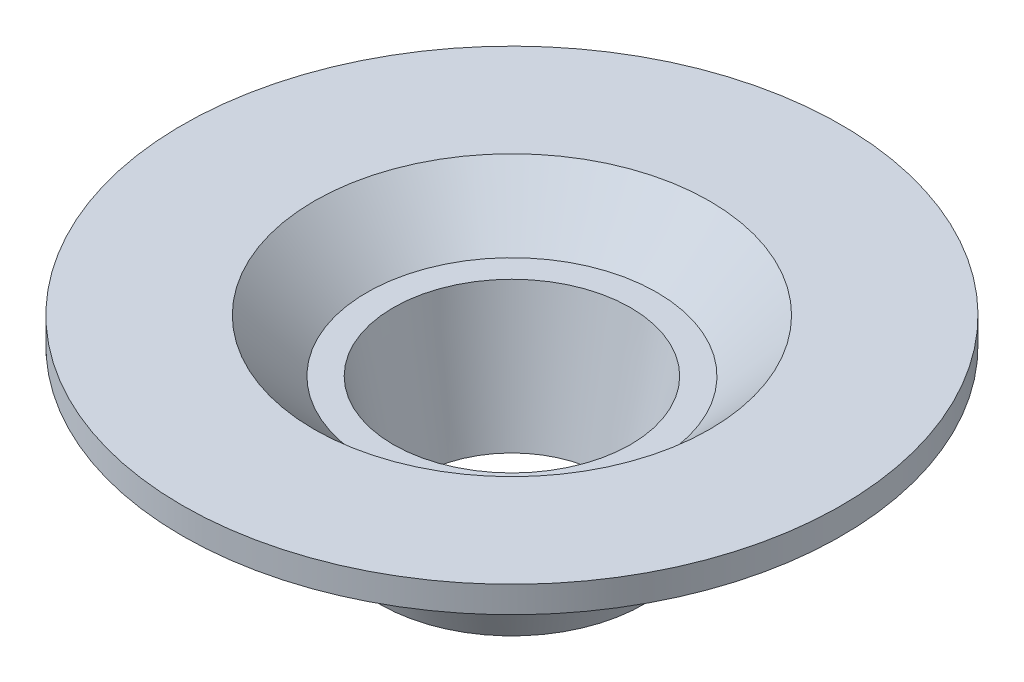
ISO-10303-21;
HEADER;
FILE_DESCRIPTION(('STEP AP214'),'2;1');
FILE_NAME('part.step','',(''),(''),'','','');
FILE_SCHEMA(('AUTOMOTIVE_DESIGN { 1 0 10303 214 1 1 1 1 }'));
ENDSEC;
DATA;
#1=APPLICATION_CONTEXT('core data for automotive mechanical design processes');
#2=APPLICATION_PROTOCOL_DEFINITION('international standard','automotive_design',2000,#1);
#3=PRODUCT_CONTEXT('',#1,'mechanical');
#4=PRODUCT('Part','Part','',(#3));
#5=PRODUCT_RELATED_PRODUCT_CATEGORY('part','',(#4));
#6=PRODUCT_DEFINITION_FORMATION('','',#4);
#7=PRODUCT_DEFINITION_CONTEXT('part definition',#1,'design');
#8=PRODUCT_DEFINITION('design','',#6,#7);
#9=PRODUCT_DEFINITION_SHAPE('','',#8);
#10=(LENGTH_UNIT() NAMED_UNIT(*) SI_UNIT(.MILLI.,.METRE.));
#11=(NAMED_UNIT(*) PLANE_ANGLE_UNIT() SI_UNIT($,.RADIAN.));
#12=(NAMED_UNIT(*) SI_UNIT($,.STERADIAN.) SOLID_ANGLE_UNIT());
#13=UNCERTAINTY_MEASURE_WITH_UNIT(LENGTH_MEASURE(1.E-05),#10,'distance_accuracy_value','');
#14=(GEOMETRIC_REPRESENTATION_CONTEXT(3) GLOBAL_UNCERTAINTY_ASSIGNED_CONTEXT((#13)) GLOBAL_UNIT_ASSIGNED_CONTEXT((#10,
#11,#12)) REPRESENTATION_CONTEXT('',''));
#15=CARTESIAN_POINT('',(0.,0.,0.));
#16=DIRECTION('',(0.,0.,1.));
#17=DIRECTION('',(1.,0.,0.));
#18=AXIS2_PLACEMENT_3D('',#15,#16,#17);
#19=CARTESIAN_POINT('',(0.,-8.13495637487969,-5.));
#20=DIRECTION('',(0.,1.,0.));
#21=DIRECTION('',(0.,0.,1.));
#22=AXIS2_PLACEMENT_3D('',#19,#20,#21);
#23=PLANE('',#22);
#24=CARTESIAN_POINT('',(0.,-8.13495637487969,0.));
#25=DIRECTION('',(0.,1.,0.));
#26=DIRECTION('',(0.,0.,1.));
#27=AXIS2_PLACEMENT_3D('',#24,#25,#26);
#28=CIRCLE('',#27,5.);
#29=CARTESIAN_POINT('',(0.,-8.13495637487969,5.));
#30=VERTEX_POINT('',#29);
#31=EDGE_CURVE('E10',#30,#30,#28,.T.);
#32=ORIENTED_EDGE('',*,*,#31,.F.);
#33=EDGE_LOOP('',(#32));
#34=FACE_BOUND('',#33,.T.);
#35=CARTESIAN_POINT('',(0.,-8.13495637487969,0.));
#36=DIRECTION('',(0.,1.,0.));
#37=DIRECTION('',(0.,0.,1.));
#38=AXIS2_PLACEMENT_3D('',#35,#36,#37);
#39=CIRCLE('',#38,3.5);
#40=CARTESIAN_POINT('',(0.,-8.13495637487969,3.5));
#41=VERTEX_POINT('',#40);
#42=EDGE_CURVE('E80',#41,#41,#39,.T.);
#43=ORIENTED_EDGE('',*,*,#42,.T.);
#44=EDGE_LOOP('',(#43));
#45=FACE_BOUND('',#44,.T.);
#46=ADVANCED_FACE('F37',(#34,#45),#23,.F.);
#47=CARTESIAN_POINT('',(0.,-8.13495637487969,0.));
#48=DIRECTION('',(0.,1.,0.));
#49=DIRECTION('',(0.,0.,1.));
#50=AXIS2_PLACEMENT_3D('',#47,#48,#49);
#51=CONICAL_SURFACE('',#50,5.,0.358770670270572);
#52=CARTESIAN_POINT('',(0.,-4.13495637487969,0.));
#53=DIRECTION('',(0.,1.,0.));
#54=DIRECTION('',(0.,0.,1.));
#55=AXIS2_PLACEMENT_3D('',#52,#53,#54);
#56=CIRCLE('',#55,6.5);
#57=CARTESIAN_POINT('',(0.,-4.13495637487969,6.5));
#58=VERTEX_POINT('',#57);
#59=EDGE_CURVE('E44',#58,#58,#56,.T.);
#60=ORIENTED_EDGE('',*,*,#59,.F.);
#61=EDGE_LOOP('',(#60));
#62=FACE_BOUND('',#61,.T.);
#63=ORIENTED_EDGE('',*,*,#31,.T.);
#64=EDGE_LOOP('',(#63));
#65=FACE_BOUND('',#64,.T.);
#66=ADVANCED_FACE('F130',(#62,#65),#51,.T.);
#67=CARTESIAN_POINT('',(0.,-4.13495637487969,-8.5));
#68=DIRECTION('',(0.,1.,0.));
#69=DIRECTION('',(0.,0.,1.));
#70=AXIS2_PLACEMENT_3D('',#67,#68,#69);
#71=PLANE('',#70);
#72=CARTESIAN_POINT('',(0.,-4.13495637487969,0.));
#73=DIRECTION('',(0.,1.,0.));
#74=DIRECTION('',(0.,0.,1.));
#75=AXIS2_PLACEMENT_3D('',#72,#73,#74);
#76=CIRCLE('',#75,8.5);
#77=CARTESIAN_POINT('',(0.,-4.13495637487969,8.5));
#78=VERTEX_POINT('',#77);
#79=EDGE_CURVE('E49',#78,#78,#76,.T.);
#80=ORIENTED_EDGE('',*,*,#79,.F.);
#81=EDGE_LOOP('',(#80));
#82=FACE_BOUND('',#81,.T.);
#83=ORIENTED_EDGE('',*,*,#59,.T.);
#84=EDGE_LOOP('',(#83));
#85=FACE_BOUND('',#84,.T.);
#86=ADVANCED_FACE('F125',(#82,#85),#71,.F.);
#87=CARTESIAN_POINT('',(0.,-4.13495637487969,0.));
#88=DIRECTION('',(0.,1.,0.));
#89=DIRECTION('',(0.,0.,1.));
#90=AXIS2_PLACEMENT_3D('',#87,#88,#89);
#91=CONICAL_SURFACE('',#90,8.5,0.785398163397448);
#92=CARTESIAN_POINT('',(0.,-2.13495637487969,0.));
#93=DIRECTION('',(0.,1.,0.));
#94=DIRECTION('',(0.,0.,1.));
#95=AXIS2_PLACEMENT_3D('',#92,#93,#94);
#96=CIRCLE('',#95,10.5);
#97=CARTESIAN_POINT('',(0.,-2.13495637487969,10.5));
#98=VERTEX_POINT('',#97);
#99=EDGE_CURVE('E54',#98,#98,#96,.T.);
#100=ORIENTED_EDGE('',*,*,#99,.F.);
#101=EDGE_LOOP('',(#100));
#102=FACE_BOUND('',#101,.T.);
#103=ORIENTED_EDGE('',*,*,#79,.T.);
#104=EDGE_LOOP('',(#103));
#105=FACE_BOUND('',#104,.T.);
#106=ADVANCED_FACE('F119',(#102,#105),#91,.T.);
#107=CARTESIAN_POINT('',(0.,-2.13495637487969,-12.5));
#108=DIRECTION('',(0.,1.,0.));
#109=DIRECTION('',(0.,0.,1.));
#110=AXIS2_PLACEMENT_3D('',#107,#108,#109);
#111=PLANE('',#110);
#112=CARTESIAN_POINT('',(0.,-2.13495637487969,0.));
#113=DIRECTION('',(0.,1.,0.));
#114=DIRECTION('',(0.,0.,1.));
#115=AXIS2_PLACEMENT_3D('',#112,#113,#114);
#116=CIRCLE('',#115,12.5);
#117=CARTESIAN_POINT('',(0.,-2.13495637487969,12.5));
#118=VERTEX_POINT('',#117);
#119=EDGE_CURVE('E60',#118,#118,#116,.T.);
#120=ORIENTED_EDGE('',*,*,#119,.F.);
#121=EDGE_LOOP('',(#120));
#122=FACE_BOUND('',#121,.T.);
#123=ORIENTED_EDGE('',*,*,#99,.T.);
#124=EDGE_LOOP('',(#123));
#125=FACE_BOUND('',#124,.T.);
#126=ADVANCED_FACE('F113',(#122,#125),#111,.F.);
#127=CARTESIAN_POINT('',(0.,0.,0.));
#128=DIRECTION('',(0.,1.,0.));
#129=DIRECTION('',(0.,0.,1.));
#130=AXIS2_PLACEMENT_3D('',#127,#128,#129);
#131=CYLINDRICAL_SURFACE('',#130,12.5);
#132=CARTESIAN_POINT('',(0.,-1.13495637487969,0.));
#133=DIRECTION('',(0.,1.,0.));
#134=DIRECTION('',(0.,0.,1.));
#135=AXIS2_PLACEMENT_3D('',#132,#133,#134);
#136=CIRCLE('',#135,12.5);
#137=CARTESIAN_POINT('',(0.,-1.13495637487969,12.5));
#138=VERTEX_POINT('',#137);
#139=EDGE_CURVE('E64',#138,#138,#136,.T.);
#140=ORIENTED_EDGE('',*,*,#139,.F.);
#141=EDGE_LOOP('',(#140));
#142=FACE_BOUND('',#141,.T.);
#143=ORIENTED_EDGE('',*,*,#119,.T.);
#144=EDGE_LOOP('',(#143));
#145=FACE_BOUND('',#144,.T.);
#146=ADVANCED_FACE('F107',(#142,#145),#131,.T.);
#147=CARTESIAN_POINT('',(0.,-1.13495637487969,-7.5));
#148=DIRECTION('',(0.,-1.,0.));
#149=DIRECTION('',(0.,0.,-1.));
#150=AXIS2_PLACEMENT_3D('',#147,#148,#149);
#151=PLANE('',#150);
#152=CARTESIAN_POINT('',(0.,-1.13495637487969,0.));
#153=DIRECTION('',(0.,1.,0.));
#154=DIRECTION('',(0.,0.,1.));
#155=AXIS2_PLACEMENT_3D('',#152,#153,#154);
#156=CIRCLE('',#155,7.5);
#157=CARTESIAN_POINT('',(0.,-1.13495637487969,7.5));
#158=VERTEX_POINT('',#157);
#159=EDGE_CURVE('E68',#158,#158,#156,.T.);
#160=ORIENTED_EDGE('',*,*,#159,.F.);
#161=EDGE_LOOP('',(#160));
#162=FACE_BOUND('',#161,.T.);
#163=ORIENTED_EDGE('',*,*,#139,.T.);
#164=EDGE_LOOP('',(#163));
#165=FACE_BOUND('',#164,.T.);
#166=ADVANCED_FACE('F101',(#162,#165),#151,.F.);
#167=CARTESIAN_POINT('',(0.,-1.13495637487969,0.));
#168=DIRECTION('',(0.,1.,0.));
#169=DIRECTION('',(0.,0.,1.));
#170=AXIS2_PLACEMENT_3D('',#167,#168,#169);
#171=CONICAL_SURFACE('',#170,7.5,0.785398163397448);
#172=CARTESIAN_POINT('',(0.,-3.13495637487969,0.));
#173=DIRECTION('',(0.,1.,0.));
#174=DIRECTION('',(0.,0.,1.));
#175=AXIS2_PLACEMENT_3D('',#172,#173,#174);
#176=CIRCLE('',#175,5.5);
#177=CARTESIAN_POINT('',(0.,-3.13495637487969,5.5));
#178=VERTEX_POINT('',#177);
#179=EDGE_CURVE('E72',#178,#178,#176,.T.);
#180=ORIENTED_EDGE('',*,*,#179,.F.);
#181=EDGE_LOOP('',(#180));
#182=FACE_BOUND('',#181,.T.);
#183=ORIENTED_EDGE('',*,*,#159,.T.);
#184=EDGE_LOOP('',(#183));
#185=FACE_BOUND('',#184,.T.);
#186=ADVANCED_FACE('F95',(#182,#185),#171,.F.);
#187=CARTESIAN_POINT('',(0.,-3.13495637487969,-4.5));
#188=DIRECTION('',(0.,-1.,0.));
#189=DIRECTION('',(0.,0.,-1.));
#190=AXIS2_PLACEMENT_3D('',#187,#188,#189);
#191=PLANE('',#190);
#192=CARTESIAN_POINT('',(0.,-3.13495637487969,0.));
#193=DIRECTION('',(0.,1.,0.));
#194=DIRECTION('',(0.,0.,1.));
#195=AXIS2_PLACEMENT_3D('',#192,#193,#194);
#196=CIRCLE('',#195,4.5);
#197=CARTESIAN_POINT('',(0.,-3.13495637487969,4.5));
#198=VERTEX_POINT('',#197);
#199=EDGE_CURVE('E76',#198,#198,#196,.T.);
#200=ORIENTED_EDGE('',*,*,#199,.F.);
#201=EDGE_LOOP('',(#200));
#202=FACE_BOUND('',#201,.T.);
#203=ORIENTED_EDGE('',*,*,#179,.T.);
#204=EDGE_LOOP('',(#203));
#205=FACE_BOUND('',#204,.T.);
#206=ADVANCED_FACE('F89',(#202,#205),#191,.F.);
#207=CARTESIAN_POINT('',(0.,-3.13495637487969,0.));
#208=DIRECTION('',(0.,1.,0.));
#209=DIRECTION('',(0.,0.,1.));
#210=AXIS2_PLACEMENT_3D('',#207,#208,#209);
#211=CONICAL_SURFACE('',#210,4.5,0.197395559849881);
#212=ORIENTED_EDGE('',*,*,#42,.F.);
#213=EDGE_LOOP('',(#212));
#214=FACE_BOUND('',#213,.T.);
#215=ORIENTED_EDGE('',*,*,#199,.T.);
#216=EDGE_LOOP('',(#215));
#217=FACE_BOUND('',#216,.T.);
#218=ADVANCED_FACE('F86',(#214,#217),#211,.F.);
#219=CLOSED_SHELL('',(#46,#66,#86,#106,#126,#146,#166,#186,#206,#218));
#220=MANIFOLD_SOLID_BREP('B2',#219);
#221=ADVANCED_BREP_SHAPE_REPRESENTATION('',(#18,#220),#14);
#222=SHAPE_DEFINITION_REPRESENTATION(#9,#221);
ENDSEC;
END-ISO-10303-21;
